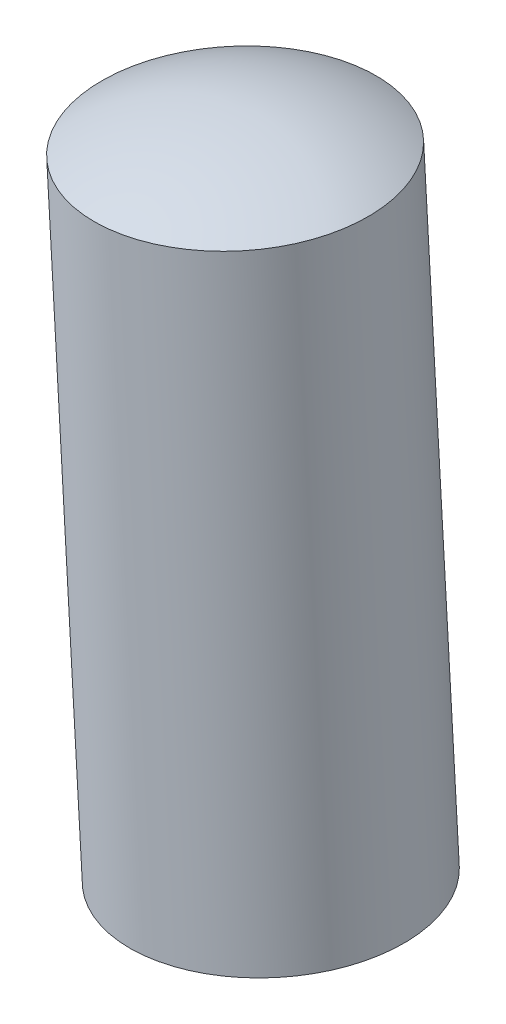
ISO-10303-21;
HEADER;
FILE_DESCRIPTION(('STEP AP214'),'2;1');
FILE_NAME('part.step','',(''),(''),'','','');
FILE_SCHEMA(('AUTOMOTIVE_DESIGN { 1 0 10303 214 1 1 1 1 }'));
ENDSEC;
DATA;
#1=APPLICATION_CONTEXT('core data for automotive mechanical design processes');
#2=APPLICATION_PROTOCOL_DEFINITION('international standard','automotive_design',2000,#1);
#3=PRODUCT_CONTEXT('',#1,'mechanical');
#4=PRODUCT('Part','Part','',(#3));
#5=PRODUCT_RELATED_PRODUCT_CATEGORY('part','',(#4));
#6=PRODUCT_DEFINITION_FORMATION('','',#4);
#7=PRODUCT_DEFINITION_CONTEXT('part definition',#1,'design');
#8=PRODUCT_DEFINITION('design','',#6,#7);
#9=PRODUCT_DEFINITION_SHAPE('','',#8);
#10=(LENGTH_UNIT() NAMED_UNIT(*) SI_UNIT(.MILLI.,.METRE.));
#11=(NAMED_UNIT(*) PLANE_ANGLE_UNIT() SI_UNIT($,.RADIAN.));
#12=(NAMED_UNIT(*) SI_UNIT($,.STERADIAN.) SOLID_ANGLE_UNIT());
#13=UNCERTAINTY_MEASURE_WITH_UNIT(LENGTH_MEASURE(1.E-05),#10,'distance_accuracy_value','');
#14=(GEOMETRIC_REPRESENTATION_CONTEXT(3) GLOBAL_UNCERTAINTY_ASSIGNED_CONTEXT((#13)) GLOBAL_UNIT_ASSIGNED_CONTEXT((#10,
#11,#12)) REPRESENTATION_CONTEXT('',''));
#15=CARTESIAN_POINT('',(0.,0.,0.));
#16=DIRECTION('',(0.,0.,1.));
#17=DIRECTION('',(1.,0.,0.));
#18=AXIS2_PLACEMENT_3D('',#15,#16,#17);
#19=CARTESIAN_POINT('',(-1.3003424420919,22.2750266261862,0.599999999999989));
#20=DIRECTION('',(0.998300423403567,0.0582774796320075,0.));
#21=DIRECTION('',(-0.0582774796320082,0.998300423403567,0.));
#22=AXIS2_PLACEMENT_3D('',#19,#20,#21);
#23=SPHERICAL_SURFACE('',#22,2.);
#24=CARTESIAN_POINT('',(-1.3003424420919,22.2750266261862,0.599999999999989));
#25=DIRECTION('',(0.0582774796320082,-0.998300423403567,0.));
#26=DIRECTION('',(0.,0.,-1.));
#27=AXIS2_PLACEMENT_3D('',#24,#25,#26);
#28=SPHERICAL_SURFACE('',#27,2.);
#29=CARTESIAN_POINT('',(-1.40128199775164,24.0041336807388,0.599999999999989));
#30=DIRECTION('',(0.0582774796320082,-0.998300423403567,0.));
#31=DIRECTION('',(0.,0.,-1.));
#32=AXIS2_PLACEMENT_3D('',#29,#30,#31);
#33=CIRCLE('',#32,1.);
#34=CARTESIAN_POINT('',(-1.40128199775164,24.0041336807388,-0.400000000000011));
#35=VERTEX_POINT('',#34);
#36=EDGE_CURVE('E11',#35,#35,#33,.T.);
#37=ORIENTED_EDGE('',*,*,#36,.F.);
#38=EDGE_LOOP('',(#37));
#39=FACE_BOUND('',#38,.T.);
#40=ADVANCED_FACE('F17',(#39),#28,.T.);
#41=CARTESIAN_POINT('',(-1.23472792190039,21.1510417918689,0.599999999999989));
#42=DIRECTION('',(0.998300423403567,0.0582774796320075,0.));
#43=DIRECTION('',(0.0582774796320075,-0.998300423403567,0.));
#44=AXIS2_PLACEMENT_3D('',#41,#42,#43);
#45=SPHERICAL_SURFACE('',#44,2.);
#46=CARTESIAN_POINT('',(-1.23472792190039,21.1510417918689,0.599999999999989));
#47=DIRECTION('',(0.0582774796320082,-0.998300423403567,0.));
#48=DIRECTION('',(0.,0.,-1.));
#49=AXIS2_PLACEMENT_3D('',#46,#47,#48);
#50=SPHERICAL_SURFACE('',#49,2.);
#51=CARTESIAN_POINT('',(-1.13378836624072,19.4219347373163,0.599999999999989));
#52=DIRECTION('',(0.0582774796320082,-0.998300423403567,0.));
#53=DIRECTION('',(0.,0.,-1.));
#54=AXIS2_PLACEMENT_3D('',#51,#52,#53);
#55=CIRCLE('',#54,1.);
#56=CARTESIAN_POINT('',(-1.13378836624072,19.4219347373163,-0.400000000000011));
#57=VERTEX_POINT('',#56);
#58=EDGE_CURVE('E21',#57,#57,#55,.T.);
#59=ORIENTED_EDGE('',*,*,#58,.T.);
#60=EDGE_LOOP('',(#59));
#61=FACE_BOUND('',#60,.T.);
#62=ADVANCED_FACE('F40',(#61),#50,.T.);
#63=CARTESIAN_POINT('',(-1.20066177411843,20.5674844731719,0.599999999999989));
#64=DIRECTION('',(0.0582774796320082,-0.998300423403567,0.));
#65=DIRECTION('',(0.,0.,-1.));
#66=AXIS2_PLACEMENT_3D('',#63,#64,#65);
#67=CYLINDRICAL_SURFACE('',#66,1.);
#68=ORIENTED_EDGE('',*,*,#36,.T.);
#69=EDGE_LOOP('',(#68));
#70=FACE_BOUND('',#69,.T.);
#71=ORIENTED_EDGE('',*,*,#58,.F.);
#72=EDGE_LOOP('',(#71));
#73=FACE_BOUND('',#72,.T.);
#74=ADVANCED_FACE('F19',(#70,#73),#67,.T.);
#75=CLOSED_SHELL('',(#40,#62,#74));
#76=MANIFOLD_SOLID_BREP('B1',#75);
#77=ADVANCED_BREP_SHAPE_REPRESENTATION('',(#18,#76),#14);
#78=SHAPE_DEFINITION_REPRESENTATION(#9,#77);
ENDSEC;
END-ISO-10303-21;
